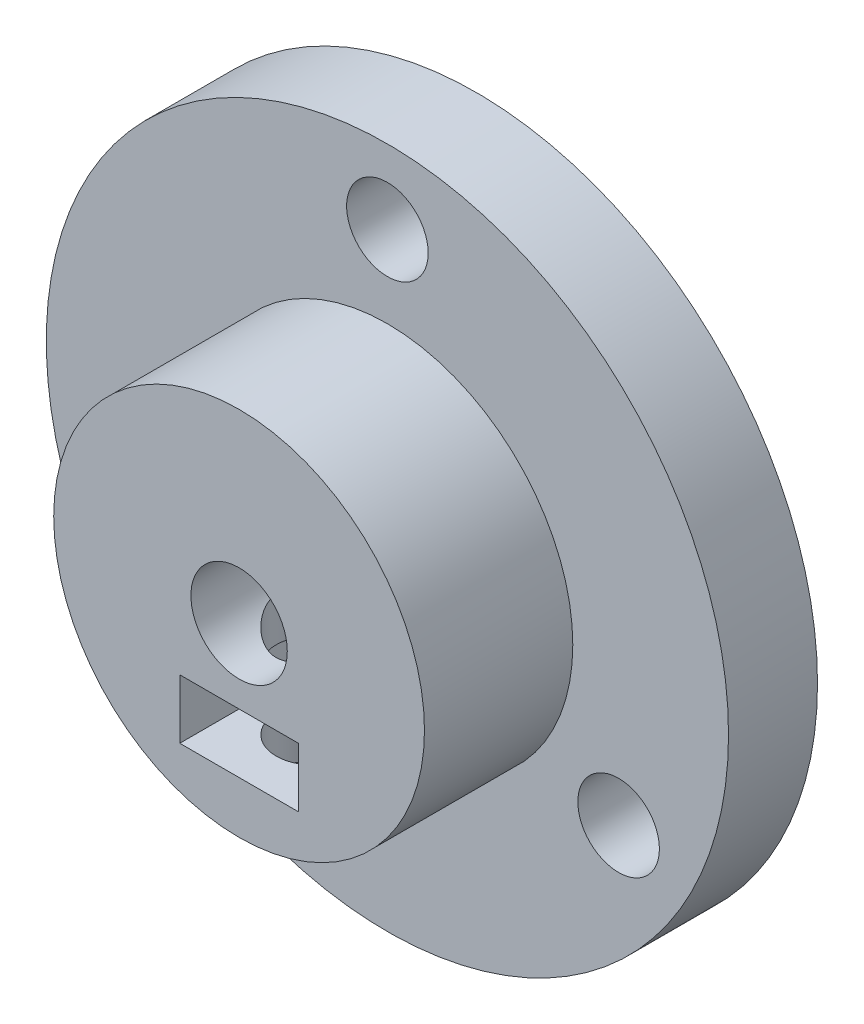
ISO-10303-21;
HEADER;
FILE_DESCRIPTION(('STEP AP214'),'2;1');
FILE_NAME('part.step','',(''),(''),'','','');
FILE_SCHEMA(('AUTOMOTIVE_DESIGN { 1 0 10303 214 1 1 1 1 }'));
ENDSEC;
DATA;
#1=APPLICATION_CONTEXT('core data for automotive mechanical design processes');
#2=APPLICATION_PROTOCOL_DEFINITION('international standard','automotive_design',2000,#1);
#3=PRODUCT_CONTEXT('',#1,'mechanical');
#4=PRODUCT('Part','Part','',(#3));
#5=PRODUCT_RELATED_PRODUCT_CATEGORY('part','',(#4));
#6=PRODUCT_DEFINITION_FORMATION('','',#4);
#7=PRODUCT_DEFINITION_CONTEXT('part definition',#1,'design');
#8=PRODUCT_DEFINITION('design','',#6,#7);
#9=PRODUCT_DEFINITION_SHAPE('','',#8);
#10=(LENGTH_UNIT() NAMED_UNIT(*) SI_UNIT(.MILLI.,.METRE.));
#11=(NAMED_UNIT(*) PLANE_ANGLE_UNIT() SI_UNIT($,.RADIAN.));
#12=(NAMED_UNIT(*) SI_UNIT($,.STERADIAN.) SOLID_ANGLE_UNIT());
#13=UNCERTAINTY_MEASURE_WITH_UNIT(LENGTH_MEASURE(1.E-05),#10,'distance_accuracy_value','');
#14=(GEOMETRIC_REPRESENTATION_CONTEXT(3) GLOBAL_UNCERTAINTY_ASSIGNED_CONTEXT((#13)) GLOBAL_UNIT_ASSIGNED_CONTEXT((#10,
#11,#12)) REPRESENTATION_CONTEXT('',''));
#15=CARTESIAN_POINT('',(0.,0.,0.));
#16=DIRECTION('',(0.,0.,1.));
#17=DIRECTION('',(1.,0.,0.));
#18=AXIS2_PLACEMENT_3D('',#15,#16,#17);
#19=CARTESIAN_POINT('',(0.,-23.001,11.));
#20=DIRECTION('',(0.,1.,0.));
#21=DIRECTION('',(0.,0.,1.));
#22=AXIS2_PLACEMENT_3D('',#19,#20,#21);
#23=CYLINDRICAL_SURFACE('',#22,2.5);
#24=CARTESIAN_POINT('',(0.,-9.,11.));
#25=DIRECTION('',(0.,-1.,0.));
#26=DIRECTION('',(0.,0.,-1.));
#27=AXIS2_PLACEMENT_3D('',#24,#25,#26);
#28=CIRCLE('',#27,2.5);
#29=CARTESIAN_POINT('',(0.,-9.,8.5));
#30=VERTEX_POINT('',#29);
#31=EDGE_CURVE('E40',#30,#30,#28,.F.);
#32=ORIENTED_EDGE('',*,*,#31,.T.);
#33=EDGE_LOOP('',(#32));
#34=FACE_BOUND('',#33,.T.);
#35=CARTESIAN_POINT('',(0.,-12.5,13.5));
#36=CARTESIAN_POINT('',(-0.138942266981583,-12.4999974395218,13.4999948887541));
#37=CARTESIAN_POINT('',(-0.277949150503806,-12.4976596294558,13.4883778925809));
#38=CARTESIAN_POINT('',(-0.552033769222549,-12.4885591405808,13.4422537497119));
#39=CARTESIAN_POINT('',(-0.68710829385339,-12.4817929465047,13.4077284179962));
#40=CARTESIAN_POINT('',(-0.949325763158283,-12.4645912319572,13.316896815948));
#41=CARTESIAN_POINT('',(-1.07647616983284,-12.454159226918,13.2606114078883));
#42=CARTESIAN_POINT('',(-1.31951997216057,-12.4307599508829,13.1279193812218));
#43=CARTESIAN_POINT('',(-1.43541403768953,-12.4177928308927,13.051513960982));
#44=CARTESIAN_POINT('',(-1.65423369328716,-12.3905541332492,12.8796537642714));
#45=CARTESIAN_POINT('',(-1.75698487789631,-12.3762686376087,12.783979111522));
#46=CARTESIAN_POINT('',(-1.94509189152007,-12.3481045113147,12.5767689590207));
#47=CARTESIAN_POINT('',(-2.03044636192606,-12.3342259125106,12.4652322216622));
#48=CARTESIAN_POINT('',(-2.18207938336905,-12.3083110453154,12.2282095174703));
#49=CARTESIAN_POINT('',(-2.24817734716467,-12.2962926841237,12.1026058905091));
#50=CARTESIAN_POINT('',(-2.35826416645077,-12.2756567014604,11.8417954524898));
#51=CARTESIAN_POINT('',(-2.4022552060931,-12.267038744049,11.7065895916341));
#52=CARTESIAN_POINT('',(-2.46631324971207,-12.2543201313051,11.4322890902302));
#53=CARTESIAN_POINT('',(-2.48668624489694,-12.2501617526797,11.2932686396444));
#54=CARTESIAN_POINT('',(-2.5038803193153,-12.2466593765157,11.0137254465891));
#55=CARTESIAN_POINT('',(-2.50070380678375,-12.247314886696,10.8732028591996));
#56=CARTESIAN_POINT('',(-2.47113643275455,-12.2533137787046,10.5968830299475));
#57=CARTESIAN_POINT('',(-2.44509635060976,-12.2585863214691,10.4610464859317));
#58=CARTESIAN_POINT('',(-2.37109471155763,-12.273113654,10.1957098083425));
#59=CARTESIAN_POINT('',(-2.3231321077517,-12.2823686339445,10.0662099777025));
#60=CARTESIAN_POINT('',(-2.2063119591868,-12.3038904625102,9.816211845741));
#61=CARTESIAN_POINT('',(-2.13731537808029,-12.3161772453426,9.69578030107707));
#62=CARTESIAN_POINT('',(-1.9804839364317,-12.3423654693265,9.46807287506796));
#63=CARTESIAN_POINT('',(-1.89264691089207,-12.3562670959591,9.36079850787211));
#64=CARTESIAN_POINT('',(-1.69874983640146,-12.3844255310365,9.16042649385766));
#65=CARTESIAN_POINT('',(-1.59239040303111,-12.3986842302726,9.06761858035217));
#66=CARTESIAN_POINT('',(-1.36546256015502,-12.4257212178602,8.90111538424694));
#67=CARTESIAN_POINT('',(-1.24489396844847,-12.4384994872243,8.82742034676605));
#68=CARTESIAN_POINT('',(-0.992648467197301,-12.4611672540222,8.70118122693506));
#69=CARTESIAN_POINT('',(-0.860954548963249,-12.4710522212068,8.64867026588866));
#70=CARTESIAN_POINT('',(-0.590372441121661,-12.4867852246965,8.56659881490358));
#71=CARTESIAN_POINT('',(-0.451485125181123,-12.4926337500133,8.53703554481593));
#72=CARTESIAN_POINT('',(-0.172948514067876,-12.4995667966717,8.50210886551431));
#73=CARTESIAN_POINT('',(-0.0333508208139401,-12.5007293663117,8.49634895114933));
#74=CARTESIAN_POINT('',(0.244812335481786,-12.4983762982526,8.50812464735545));
#75=CARTESIAN_POINT('',(0.383377856109484,-12.4948609235362,8.52565894838149));
#76=CARTESIAN_POINT('',(0.654264149866353,-12.4835958002004,8.58319593385989));
#77=CARTESIAN_POINT('',(0.786629870849759,-12.4758844101052,8.62299517124476));
#78=CARTESIAN_POINT('',(1.04280906874917,-12.4570888015258,8.72370995663952));
#79=CARTESIAN_POINT('',(1.16662190409385,-12.4460043303557,8.78462708669207));
#80=CARTESIAN_POINT('',(1.40385293421554,-12.4214977883324,8.92670622662828));
#81=CARTESIAN_POINT('',(1.51712531688047,-12.4080487609263,9.00810695259736));
#82=CARTESIAN_POINT('',(1.72854504779802,-12.3803683707471,9.1885229780182));
#83=CARTESIAN_POINT('',(1.82669077232691,-12.3661369242097,9.28754016599967));
#84=CARTESIAN_POINT('',(2.00660147693544,-12.3382325889241,9.50218337972781));
#85=CARTESIAN_POINT('',(2.08809425612164,-12.3245715058326,9.61803936055334));
#86=CARTESIAN_POINT('',(2.23046355012802,-12.2996047949049,9.8620284033917));
#87=CARTESIAN_POINT('',(2.29134088980726,-12.2882990728336,9.99016097393388));
#88=CARTESIAN_POINT('',(2.3903796039549,-12.2694185146096,10.2544206153739));
#89=CARTESIAN_POINT('',(2.42865874947763,-12.2618243718047,10.3905021030258));
#90=CARTESIAN_POINT('',(2.48177162906799,-12.2511859198006,10.6673336337273));
#91=CARTESIAN_POINT('',(2.49660842056278,-12.2481410172778,10.8080830655234));
#92=CARTESIAN_POINT('',(2.50230227716867,-12.2469787407845,11.0875221613608));
#93=CARTESIAN_POINT('',(2.49358947017724,-12.2487729797325,11.2262028723175));
#94=CARTESIAN_POINT('',(2.45338076025015,-12.2568893371153,11.5000791247626));
#95=CARTESIAN_POINT('',(2.42188504032325,-12.2632114191792,11.635274694237));
#96=CARTESIAN_POINT('',(2.33719642124739,-12.279631605479,11.8980692781014));
#97=CARTESIAN_POINT('',(2.28405626679336,-12.2897205254708,12.025685901256));
#98=CARTESIAN_POINT('',(2.15763661150401,-12.3125428743543,12.2702593018361));
#99=CARTESIAN_POINT('',(2.08435542193721,-12.3252765249724,12.3872151843128));
#100=CARTESIAN_POINT('',(1.91826478696603,-12.3522240130806,12.6092889303758));
#101=CARTESIAN_POINT('',(1.82514471808795,-12.3664593227425,12.714171913169));
#102=CARTESIAN_POINT('',(1.62266092253285,-12.3946520467989,12.9069655138229));
#103=CARTESIAN_POINT('',(1.51329346788334,-12.4086093965796,12.9948722257932));
#104=CARTESIAN_POINT('',(1.28004407272062,-12.4348458096993,13.1520866098661));
#105=CARTESIAN_POINT('',(1.15602221107459,-12.4471057804812,13.2211900082001));
#106=CARTESIAN_POINT('',(0.89791590235183,-12.468378127125,13.3374653064915));
#107=CARTESIAN_POINT('',(0.763840652157814,-12.4773934284654,13.3846569738312));
#108=CARTESIAN_POINT('',(0.524553722309448,-12.4894093148843,13.4466298701118));
#109=CARTESIAN_POINT('',(0.420704160034461,-12.4933575789613,13.4666079842694));
#110=CARTESIAN_POINT('',(0.211248813025168,-12.4986538534973,13.4932947808959));
#111=CARTESIAN_POINT('',(0.105643084371548,-12.5000019468289,13.5000038862744));
#112=CARTESIAN_POINT('',(0.,-12.5,13.5));
#113=B_SPLINE_CURVE_WITH_KNOTS('',3,(#35,#36,#37,#38,#39,#40,#41,#42,#43,#44,#45,#46,#47,#48,
#49,#50,#51,#52,#53,#54,#55,#56,#57,#58,#59,#60,#61,#62,#63,#64,#65,#66,#67,#68,#69,#70,#71,#72,
#73,#74,#75,#76,#77,#78,#79,#80,#81,#82,#83,#84,#85,#86,#87,#88,#89,#90,#91,#92,#93,#94,#95,#96,
#97,#98,#99,#100,#101,#102,#103,#104,#105,#106,#107,#108,#109,#110,#111,#112),.UNSPECIFIED.,.T.,
.F.,(4,2,2,2,2,2,2,2,2,2,2,2,2,2,2,2,2,2,2,2,2,2,2,2,2,2,2,2,2,2,2,2,2,2,2,2,2,2,4),(0.,
0.416440326653146,0.833211626728308,1.24958433812585,1.66593225557716,2.08733167528047,
2.50876399186842,2.93402987514807,3.35925373412994,3.77890462758969,4.19851260703063,
4.61179317515696,5.02509348134324,5.44118725508982,5.85732886874176,6.28095631228377,
6.70458918849551,7.1288818713506,7.5531231424509,7.97026839190663,8.38739019144669,
8.80076134876809,9.21416348040056,9.63262665083397,10.0511347086483,10.4760157144806,
10.9008797180867,11.3235095258181,11.7460842082604,12.1609930641925,12.5758985873152,
12.9897990313278,13.4037341895467,13.8247019059786,14.2457663633233,14.6712374168909,
15.096323887938,15.4129693822474,15.7296047842749),.UNSPECIFIED.);
#114=CARTESIAN_POINT('',(0.,-12.5,13.5));
#115=VERTEX_POINT('',#114);
#116=EDGE_CURVE('E134',#115,#115,#113,.T.);
#117=ORIENTED_EDGE('',*,*,#116,.T.);
#118=EDGE_LOOP('',(#117));
#119=FACE_BOUND('',#118,.T.);
#120=ADVANCED_FACE('F36',(#34,#119),#23,.F.);
#121=CARTESIAN_POINT('',(0.,0.,6.));
#122=DIRECTION('',(0.,0.,-1.));
#123=DIRECTION('',(-1.,0.,0.));
#124=AXIS2_PLACEMENT_3D('',#121,#122,#123);
#125=CYLINDRICAL_SURFACE('',#124,23.);
#126=CARTESIAN_POINT('',(0.,0.,6.));
#127=DIRECTION('',(0.,0.,1.));
#128=DIRECTION('',(1.,0.,0.));
#129=AXIS2_PLACEMENT_3D('',#126,#127,#128);
#130=CIRCLE('',#129,23.);
#131=CARTESIAN_POINT('',(23.,0.,6.));
#132=VERTEX_POINT('',#131);
#133=EDGE_CURVE('E12',#132,#132,#130,.T.);
#134=ORIENTED_EDGE('',*,*,#133,.F.);
#135=EDGE_LOOP('',(#134));
#136=FACE_BOUND('',#135,.T.);
#137=CARTESIAN_POINT('',(0.,0.,0.));
#138=DIRECTION('',(0.,0.,1.));
#139=DIRECTION('',(1.,0.,0.));
#140=AXIS2_PLACEMENT_3D('',#137,#138,#139);
#141=CIRCLE('',#140,23.);
#142=CARTESIAN_POINT('',(23.,0.,0.));
#143=VERTEX_POINT('',#142);
#144=EDGE_CURVE('E45',#143,#143,#141,.T.);
#145=ORIENTED_EDGE('',*,*,#144,.T.);
#146=EDGE_LOOP('',(#145));
#147=FACE_BOUND('',#146,.T.);
#148=ADVANCED_FACE('F38',(#136,#147),#125,.T.);
#149=CARTESIAN_POINT('',(0.,0.,6.));
#150=DIRECTION('',(0.,0.,1.));
#151=DIRECTION('',(1.,0.,0.));
#152=AXIS2_PLACEMENT_3D('',#149,#150,#151);
#153=PLANE('',#152);
#154=CARTESIAN_POINT('',(15.58845726812,-8.9999999999998,6.));
#155=DIRECTION('',(0.,0.,1.));
#156=DIRECTION('',(-0.499999999999989,-0.866025403784445,0.));
#157=AXIS2_PLACEMENT_3D('',#154,#155,#156);
#158=CIRCLE('',#157,2.75);
#159=CARTESIAN_POINT('',(14.21345726812,-11.381569860407,6.));
#160=VERTEX_POINT('',#159);
#161=EDGE_CURVE('E116',#160,#160,#158,.T.);
#162=ORIENTED_EDGE('',*,*,#161,.F.);
#163=EDGE_LOOP('',(#162));
#164=FACE_BOUND('',#163,.T.);
#165=CARTESIAN_POINT('',(-15.5884572681199,-8.99999999999998,6.));
#166=DIRECTION('',(0.,0.,1.));
#167=DIRECTION('',(-0.499999999999999,0.866025403784439,0.));
#168=AXIS2_PLACEMENT_3D('',#165,#166,#167);
#169=CIRCLE('',#168,2.75);
#170=CARTESIAN_POINT('',(-16.9634572681199,-6.61843013959278,6.));
#171=VERTEX_POINT('',#170);
#172=EDGE_CURVE('E122',#171,#171,#169,.T.);
#173=ORIENTED_EDGE('',*,*,#172,.F.);
#174=EDGE_LOOP('',(#173));
#175=FACE_BOUND('',#174,.T.);
#176=CARTESIAN_POINT('',(0.,18.,6.));
#177=DIRECTION('',(0.,0.,1.));
#178=DIRECTION('',(1.,0.,0.));
#179=AXIS2_PLACEMENT_3D('',#176,#177,#178);
#180=CIRCLE('',#179,2.75);
#181=CARTESIAN_POINT('',(2.75,18.,6.));
#182=VERTEX_POINT('',#181);
#183=EDGE_CURVE('E128',#182,#182,#180,.T.);
#184=ORIENTED_EDGE('',*,*,#183,.F.);
#185=EDGE_LOOP('',(#184));
#186=FACE_BOUND('',#185,.T.);
#187=CARTESIAN_POINT('',(0.,0.,6.));
#188=DIRECTION('',(0.,0.,1.));
#189=DIRECTION('',(1.,0.,0.));
#190=AXIS2_PLACEMENT_3D('',#187,#188,#189);
#191=CIRCLE('',#190,12.5);
#192=CARTESIAN_POINT('',(12.5,0.,6.));
#193=VERTEX_POINT('',#192);
#194=EDGE_CURVE('E204',#193,#193,#191,.T.);
#195=ORIENTED_EDGE('',*,*,#194,.F.);
#196=EDGE_LOOP('',(#195));
#197=FACE_BOUND('',#196,.T.);
#198=ORIENTED_EDGE('',*,*,#133,.T.);
#199=EDGE_LOOP('',(#198));
#200=FACE_BOUND('',#199,.T.);
#201=ADVANCED_FACE('F187',(#164,#175,#186,#197,#200),#153,.T.);
#202=CARTESIAN_POINT('',(0.,0.,0.));
#203=DIRECTION('',(0.,0.,1.));
#204=DIRECTION('',(1.,0.,0.));
#205=AXIS2_PLACEMENT_3D('',#202,#203,#204);
#206=PLANE('',#205);
#207=CARTESIAN_POINT('',(15.58845726812,-8.9999999999998,0.));
#208=DIRECTION('',(0.,0.,1.));
#209=DIRECTION('',(1.,0.,0.));
#210=AXIS2_PLACEMENT_3D('',#207,#208,#209);
#211=CIRCLE('',#210,2.75);
#212=CARTESIAN_POINT('',(18.33845726812,-8.9999999999998,0.));
#213=VERTEX_POINT('',#212);
#214=EDGE_CURVE('E119',#213,#213,#211,.F.);
#215=ORIENTED_EDGE('',*,*,#214,.F.);
#216=EDGE_LOOP('',(#215));
#217=FACE_BOUND('',#216,.T.);
#218=CARTESIAN_POINT('',(-15.5884572681199,-8.99999999999998,0.));
#219=DIRECTION('',(0.,0.,1.));
#220=DIRECTION('',(1.,0.,0.));
#221=AXIS2_PLACEMENT_3D('',#218,#219,#220);
#222=CIRCLE('',#221,2.75);
#223=CARTESIAN_POINT('',(-12.8384572681199,-8.99999999999998,0.));
#224=VERTEX_POINT('',#223);
#225=EDGE_CURVE('E125',#224,#224,#222,.F.);
#226=ORIENTED_EDGE('',*,*,#225,.F.);
#227=EDGE_LOOP('',(#226));
#228=FACE_BOUND('',#227,.T.);
#229=CARTESIAN_POINT('',(0.,18.,0.));
#230=DIRECTION('',(0.,0.,1.));
#231=DIRECTION('',(1.,0.,0.));
#232=AXIS2_PLACEMENT_3D('',#229,#230,#231);
#233=CIRCLE('',#232,2.75);
#234=CARTESIAN_POINT('',(2.75,18.,0.));
#235=VERTEX_POINT('',#234);
#236=EDGE_CURVE('E131',#235,#235,#233,.F.);
#237=ORIENTED_EDGE('',*,*,#236,.F.);
#238=EDGE_LOOP('',(#237));
#239=FACE_BOUND('',#238,.T.);
#240=CARTESIAN_POINT('',(0.,0.,0.));
#241=DIRECTION('',(0.,0.,1.));
#242=DIRECTION('',(1.,0.,0.));
#243=AXIS2_PLACEMENT_3D('',#240,#241,#242);
#244=CIRCLE('',#243,3.25);
#245=CARTESIAN_POINT('',(3.25,0.,0.));
#246=VERTEX_POINT('',#245);
#247=EDGE_CURVE('E201',#246,#246,#244,.F.);
#248=ORIENTED_EDGE('',*,*,#247,.F.);
#249=EDGE_LOOP('',(#248));
#250=FACE_BOUND('',#249,.T.);
#251=ORIENTED_EDGE('',*,*,#144,.F.);
#252=EDGE_LOOP('',(#251));
#253=FACE_BOUND('',#252,.T.);
#254=ADVANCED_FACE('F216',(#217,#228,#239,#250,#253),#206,.F.);
#255=CARTESIAN_POINT('',(0.,0.,16.));
#256=DIRECTION('',(0.,0.,-1.));
#257=DIRECTION('',(-1.,0.,0.));
#258=AXIS2_PLACEMENT_3D('',#255,#256,#257);
#259=CYLINDRICAL_SURFACE('',#258,12.5);
#260=ORIENTED_EDGE('',*,*,#116,.F.);
#261=EDGE_LOOP('',(#260));
#262=FACE_BOUND('',#261,.T.);
#263=CARTESIAN_POINT('',(0.,0.,16.));
#264=DIRECTION('',(0.,0.,1.));
#265=DIRECTION('',(1.,0.,0.));
#266=AXIS2_PLACEMENT_3D('',#263,#264,#265);
#267=CIRCLE('',#266,12.5);
#268=CARTESIAN_POINT('',(12.5,0.,16.));
#269=VERTEX_POINT('',#268);
#270=EDGE_CURVE('E206',#269,#269,#267,.T.);
#271=ORIENTED_EDGE('',*,*,#270,.F.);
#272=EDGE_LOOP('',(#271));
#273=FACE_BOUND('',#272,.T.);
#274=ORIENTED_EDGE('',*,*,#194,.T.);
#275=EDGE_LOOP('',(#274));
#276=FACE_BOUND('',#275,.T.);
#277=ADVANCED_FACE('F218',(#262,#273,#276),#259,.T.);
#278=CARTESIAN_POINT('',(0.,0.,16.));
#279=DIRECTION('',(0.,0.,1.));
#280=DIRECTION('',(1.,0.,0.));
#281=AXIS2_PLACEMENT_3D('',#278,#279,#280);
#282=PLANE('',#281);
#283=DIRECTION('',(0.,1.,0.));
#284=VECTOR('',#283,1.);
#285=CARTESIAN_POINT('',(4.,-5.,16.));
#286=LINE('',#285,#284);
#287=CARTESIAN_POINT('',(4.,-9.,16.));
#288=VERTEX_POINT('',#287);
#289=CARTESIAN_POINT('',(4.,-5.,16.));
#290=VERTEX_POINT('',#289);
#291=EDGE_CURVE('E53',#288,#290,#286,.T.);
#292=ORIENTED_EDGE('',*,*,#291,.F.);
#293=DIRECTION('',(1.,0.,0.));
#294=VECTOR('',#293,1.);
#295=CARTESIAN_POINT('',(-4.,-9.,16.));
#296=LINE('',#295,#294);
#297=CARTESIAN_POINT('',(-4.,-9.,16.));
#298=VERTEX_POINT('',#297);
#299=EDGE_CURVE('E103',#298,#288,#296,.T.);
#300=ORIENTED_EDGE('',*,*,#299,.F.);
#301=DIRECTION('',(0.,-1.,0.));
#302=VECTOR('',#301,1.);
#303=CARTESIAN_POINT('',(-4.,-5.,16.));
#304=LINE('',#303,#302);
#305=CARTESIAN_POINT('',(-4.,-5.,16.));
#306=VERTEX_POINT('',#305);
#307=EDGE_CURVE('E86',#306,#298,#304,.T.);
#308=ORIENTED_EDGE('',*,*,#307,.F.);
#309=DIRECTION('',(-1.,0.,0.));
#310=VECTOR('',#309,1.);
#311=CARTESIAN_POINT('',(-4.,-5.,16.));
#312=LINE('',#311,#310);
#313=EDGE_CURVE('E95',#290,#306,#312,.T.);
#314=ORIENTED_EDGE('',*,*,#313,.F.);
#315=EDGE_LOOP('',(#292,#300,#308,#314));
#316=FACE_BOUND('',#315,.T.);
#317=CARTESIAN_POINT('',(0.,0.,16.));
#318=DIRECTION('',(0.,0.,1.));
#319=DIRECTION('',(1.,0.,0.));
#320=AXIS2_PLACEMENT_3D('',#317,#318,#319);
#321=CIRCLE('',#320,3.25);
#322=CARTESIAN_POINT('',(3.25,0.,16.));
#323=VERTEX_POINT('',#322);
#324=EDGE_CURVE('E142',#323,#323,#321,.T.);
#325=ORIENTED_EDGE('',*,*,#324,.F.);
#326=EDGE_LOOP('',(#325));
#327=FACE_BOUND('',#326,.T.);
#328=ORIENTED_EDGE('',*,*,#270,.T.);
#329=EDGE_LOOP('',(#328));
#330=FACE_BOUND('',#329,.T.);
#331=ADVANCED_FACE('F100',(#316,#327,#330),#282,.T.);
#332=CARTESIAN_POINT('',(0.,0.,-9.19238815542512));
#333=DIRECTION('',(0.,0.,1.));
#334=DIRECTION('',(1.,0.,0.));
#335=AXIS2_PLACEMENT_3D('',#332,#333,#334);
#336=CYLINDRICAL_SURFACE('',#335,3.25);
#337=CARTESIAN_POINT('',(0.,-3.25,13.5));
#338=CARTESIAN_POINT('',(-0.121348553572939,-3.24999045350386,13.4999901110935));
#339=CARTESIAN_POINT('',(-0.242813691183046,-3.24313674214412,13.4910976976686));
#340=CARTESIAN_POINT('',(-0.481831137273764,-3.21634389171274,13.4561126311426));
#341=CARTESIAN_POINT('',(-0.599376959734738,-3.19638409318161,13.4299928217676));
#342=CARTESIAN_POINT('',(-0.826536911092769,-3.14528524520748,13.3623729845508));
#343=CARTESIAN_POINT('',(-0.936193030962689,-3.11421160506572,13.3209629007282));
#344=CARTESIAN_POINT('',(-1.14623785494923,-3.04318083044143,13.2247473412022));
#345=CARTESIAN_POINT('',(-1.24662701927908,-3.00322413744313,13.1699425311979));
#346=CARTESIAN_POINT('',(-1.44600844121602,-2.91283957929087,13.0431119123073));
#347=CARTESIAN_POINT('',(-1.54398850368458,-2.86178138460674,12.9699536928457));
#348=CARTESIAN_POINT('',(-1.72706898598944,-2.75517356947267,12.8116045783565));
#349=CARTESIAN_POINT('',(-1.81215048569007,-2.69961753105323,12.7263963550591));
#350=CARTESIAN_POINT('',(-1.98575292216533,-2.57545045421695,12.5257718989664));
#351=CARTESIAN_POINT('',(-2.07113497880181,-2.50658291949386,12.4077893002521));
#352=CARTESIAN_POINT('',(-2.2212796027211,-2.37452117616202,12.1564215181657));
#353=CARTESIAN_POINT('',(-2.2860663128604,-2.31132038761201,12.0230546209368));
#354=CARTESIAN_POINT('',(-2.37350245752466,-2.22068967712353,11.7911414976279));
#355=CARTESIAN_POINT('',(-2.40294643390421,-2.18852466882349,11.6970328862035));
#356=CARTESIAN_POINT('',(-2.45084990332516,-2.13474505533935,11.5032426116097));
#357=CARTESIAN_POINT('',(-2.46933518656955,-2.11310570080643,11.4035746420864));
#358=CARTESIAN_POINT('',(-2.49416209263567,-2.08376164397217,11.1994968443807));
#359=CARTESIAN_POINT('',(-2.50037313299083,-2.07620683083073,11.0950479968003));
#360=CARTESIAN_POINT('',(-2.49959192937503,-2.07714716023308,10.8862604328367));
#361=CARTESIAN_POINT('',(-2.4925986946756,-2.08564350710965,10.7819217253051));
#362=CARTESIAN_POINT('',(-2.46781267537085,-2.114872580323,10.5900064256641));
#363=CARTESIAN_POINT('',(-2.45147916218909,-2.13394293697894,10.5019649048181));
#364=CARTESIAN_POINT('',(-2.41022538545488,-2.1804317450951,10.3302042392671));
#365=CARTESIAN_POINT('',(-2.38529576383677,-2.20785929072228,10.2464899200116));
#366=CARTESIAN_POINT('',(-2.30888444465928,-2.2882922644855,10.0307555792468));
#367=CARTESIAN_POINT('',(-2.25070324048774,-2.34628974955749,9.90297736593192));
#368=CARTESIAN_POINT('',(-2.11571576357108,-2.46872690116902,9.66096324719528));
#369=CARTESIAN_POINT('',(-2.03886211073163,-2.53318270683204,9.54676291040301));
#370=CARTESIAN_POINT('',(-1.86473551868168,-2.66411839535363,9.32882608099276));
#371=CARTESIAN_POINT('',(-1.76687749698615,-2.73059560749075,9.22555334606421));
#372=CARTESIAN_POINT('',(-1.55301590868676,-2.85763379610431,9.03568911126613));
#373=CARTESIAN_POINT('',(-1.43704522023972,-2.91820517545496,8.94906800873174));
#374=CARTESIAN_POINT('',(-1.2106339979163,-3.01815770073048,8.8094101446316));
#375=CARTESIAN_POINT('',(-1.10302179821517,-3.05938925500898,8.75313064250296));
#376=CARTESIAN_POINT('',(-0.877760004905152,-3.13145103401655,8.65595403698233));
#377=CARTESIAN_POINT('',(-0.760116078876753,-3.16228708370275,8.61504831765287));
#378=CARTESIAN_POINT('',(-0.516571200110349,-3.21110056102949,8.55069164420213));
#379=CARTESIAN_POINT('',(-0.390617749579285,-3.22898553479023,8.52736614276741));
#380=CARTESIAN_POINT('',(-0.135412984561603,-3.2496942471058,8.5003816805261));
#381=CARTESIAN_POINT('',(-0.0061638057050163,-3.2525275018773,8.49671029369807));
#382=CARTESIAN_POINT('',(0.235764655836953,-3.24343250361131,8.50854261726005));
#383=CARTESIAN_POINT('',(0.348624757135461,-3.23318067853943,8.52186853792155));
#384=CARTESIAN_POINT('',(0.5699851544815,-3.20158084242707,8.56324022915985));
#385=CARTESIAN_POINT('',(0.678484715761967,-3.18023096970003,8.59128846939896));
#386=CARTESIAN_POINT('',(0.890464533830693,-3.12757389412467,8.66124880543788));
#387=CARTESIAN_POINT('',(0.993826989564815,-3.09610240543415,8.70339013298607));
#388=CARTESIAN_POINT('',(1.19188084801526,-3.02539097882099,8.79964630766413));
#389=CARTESIAN_POINT('',(1.28657080493337,-2.98614974903475,8.85376314612108));
#390=CARTESIAN_POINT('',(1.48090741528084,-2.89528883822034,8.9819400600439));
#391=CARTESIAN_POINT('',(1.57889783677964,-2.84269339646409,9.05780821454179));
#392=CARTESIAN_POINT('',(1.76159121809807,-2.73324893561082,9.22182446721173));
#393=CARTESIAN_POINT('',(1.84626965492683,-2.67639234468686,9.30999467697185));
#394=CARTESIAN_POINT('',(1.97091677455521,-2.58483738864233,9.46023374232235));
#395=CARTESIAN_POINT('',(2.0153025314138,-2.55028964843412,9.51879453526294));
#396=CARTESIAN_POINT('',(2.09894926990365,-2.48189994603675,9.63991489230918));
#397=CARTESIAN_POINT('',(2.13820849793904,-2.44805822866054,9.70247581386691));
#398=CARTESIAN_POINT('',(2.21133153078824,-2.38221107490474,9.83145412363114));
#399=CARTESIAN_POINT('',(2.24520353483068,-2.350202896368,9.89786543726439));
#400=CARTESIAN_POINT('',(2.30730742148475,-2.28926302069561,10.0346133432003));
#401=CARTESIAN_POINT('',(2.33554072339724,-2.26033055024242,10.1049489420159));
#402=CARTESIAN_POINT('',(2.39217341004581,-2.20047668217637,10.2674527608577));
#403=CARTESIAN_POINT('',(2.4188803755898,-2.17083894453747,10.3607122400671));
#404=CARTESIAN_POINT('',(2.46152423537021,-2.12237089694493,10.5522500442763));
#405=CARTESIAN_POINT('',(2.47748736401259,-2.10351427863679,10.650515509176));
#406=CARTESIAN_POINT('',(2.49759550494928,-2.07961265393486,10.8509358906066));
#407=CARTESIAN_POINT('',(2.50163199954093,-2.0746944866777,10.9531180031329));
#408=CARTESIAN_POINT('',(2.49715911512228,-2.08007233986507,11.156824755699));
#409=CARTESIAN_POINT('',(2.48864233114791,-2.09037734020356,11.2583489721678));
#410=CARTESIAN_POINT('',(2.45833090529554,-2.12595469901967,11.4679955078786));
#411=CARTESIAN_POINT('',(2.43521265354506,-2.15271101483804,11.5756609611802));
#412=CARTESIAN_POINT('',(2.37637318485219,-2.21748825385186,11.7839867896695));
#413=CARTESIAN_POINT('',(2.34061841539303,-2.25553912287913,11.8846276528158));
#414=CARTESIAN_POINT('',(2.24047066907344,-2.35577390982544,12.1192756868882));
#415=CARTESIAN_POINT('',(2.17036187195915,-2.42135483730996,12.249370838816));
#416=CARTESIAN_POINT('',(2.00974237178779,-2.5562679567725,12.4941175509216));
#417=CARTESIAN_POINT('',(1.91920436050694,-2.62560507458904,12.6087481084293));
#418=CARTESIAN_POINT('',(1.71626272941882,-2.76265874918916,12.82394598204));
#419=CARTESIAN_POINT('',(1.60342204139121,-2.83030613488936,12.924148590999));
#420=CARTESIAN_POINT('',(1.35805430643705,-2.95585478606715,13.1044564157106));
#421=CARTESIAN_POINT('',(1.22557030720501,-3.01377678693476,13.18460457305));
#422=CARTESIAN_POINT('',(0.980423317008698,-3.10056051993675,13.3026307667997));
#423=CARTESIAN_POINT('',(0.871722478701705,-3.13305837454582,13.3460820984045));
#424=CARTESIAN_POINT('',(0.646901307498261,-3.18705097130749,13.4177170259811));
#425=CARTESIAN_POINT('',(0.53079756358862,-3.20856940527983,13.4459335040393));
#426=CARTESIAN_POINT('',(0.344772963461902,-3.23238737897786,13.4770699415088));
#427=CARTESIAN_POINT('',(0.276287230790281,-3.23896972999378,13.4856465160746));
#428=CARTESIAN_POINT('',(0.138547117331003,-3.24777926043796,13.4971150139095));
#429=CARTESIAN_POINT('',(0.0692925656478077,-3.25000545124924,13.5000056467727));
#430=CARTESIAN_POINT('',(0.,-3.25,13.5));
#431=B_SPLINE_CURVE_WITH_KNOTS('',3,(#337,#338,#339,#340,#341,#342,#343,#344,#345,#346,#347,
#348,#349,#350,#351,#352,#353,#354,#355,#356,#357,#358,#359,#360,#361,#362,#363,#364,#365,#366,
#367,#368,#369,#370,#371,#372,#373,#374,#375,#376,#377,#378,#379,#380,#381,#382,#383,#384,#385,
#386,#387,#388,#389,#390,#391,#392,#393,#394,#395,#396,#397,#398,#399,#400,#401,#402,#403,#404,
#405,#406,#407,#408,#409,#410,#411,#412,#413,#414,#415,#416,#417,#418,#419,#420,#421,#422,#423,
#424,#425,#426,#427,#428,#429,#430),.UNSPECIFIED.,.T.,.F.,(4,2,2,2,2,2,2,2,2,2,2,2,2,2,2,2,2,2,
2,2,2,2,2,2,2,2,2,2,2,2,2,2,2,2,2,2,2,2,2,2,2,2,2,2,2,2,4),(0.,0.363751507624913,
0.728077786996625,1.09029422434735,1.45249266370743,1.84862764937112,2.24533819384756,
2.72668603253498,3.20746751341441,3.51764073538693,3.82708106730641,4.1397961015551,
4.45253460002256,4.72617933081476,5.00012290761785,5.45334988690256,5.90773913571353,
6.37697365087223,6.84536610310162,7.22859533181235,7.61160946575625,7.9973315696974,
8.38280977775316,8.72351191029883,9.06427121374374,9.41086704510604,9.7575205529209,
10.1599825831496,10.5631775434252,10.8065442411525,11.0499939687653,11.2930695507043,
11.5360838714895,11.839315614088,12.1418042097708,12.4470367313326,12.7524493764053,
13.0905515123328,13.4295582072215,13.9120851145945,14.3952608890974,14.8890623488925,
15.3817972296054,15.744831323638,16.1070787000162,16.314741306465,16.522451035831),.UNSPECIFIED.);
#432=CARTESIAN_POINT('',(0.,-3.25,13.5));
#433=VERTEX_POINT('',#432);
#434=EDGE_CURVE('E141',#433,#433,#431,.T.);
#435=ORIENTED_EDGE('',*,*,#434,.T.);
#436=EDGE_LOOP('',(#435));
#437=FACE_BOUND('',#436,.T.);
#438=ORIENTED_EDGE('',*,*,#247,.T.);
#439=EDGE_LOOP('',(#438));
#440=FACE_BOUND('',#439,.T.);
#441=ORIENTED_EDGE('',*,*,#324,.T.);
#442=EDGE_LOOP('',(#441));
#443=FACE_BOUND('',#442,.T.);
#444=ADVANCED_FACE('F149',(#437,#440,#443),#336,.F.);
#445=CARTESIAN_POINT('',(0.,-5.,11.));
#446=DIRECTION('',(0.,1.,0.));
#447=DIRECTION('',(-1.,0.,0.));
#448=AXIS2_PLACEMENT_3D('',#445,#446,#447);
#449=CIRCLE('',#448,2.5);
#450=CARTESIAN_POINT('',(-2.5,-5.,11.));
#451=VERTEX_POINT('',#450);
#452=EDGE_CURVE('E114',#451,#451,#449,.F.);
#453=ORIENTED_EDGE('',*,*,#452,.T.);
#454=EDGE_LOOP('',(#453));
#455=FACE_BOUND('',#454,.T.);
#456=ORIENTED_EDGE('',*,*,#434,.F.);
#457=EDGE_LOOP('',(#456));
#458=FACE_BOUND('',#457,.T.);
#459=ADVANCED_FACE('F144',(#455,#458),#23,.F.);
#460=CARTESIAN_POINT('',(0.,18.,-7.77817459305202));
#461=DIRECTION('',(0.,0.,1.));
#462=DIRECTION('',(1.,0.,0.));
#463=AXIS2_PLACEMENT_3D('',#460,#461,#462);
#464=CYLINDRICAL_SURFACE('',#463,2.75);
#465=ORIENTED_EDGE('',*,*,#236,.T.);
#466=EDGE_LOOP('',(#465));
#467=FACE_BOUND('',#466,.T.);
#468=ORIENTED_EDGE('',*,*,#183,.T.);
#469=EDGE_LOOP('',(#468));
#470=FACE_BOUND('',#469,.T.);
#471=ADVANCED_FACE('F190',(#467,#470),#464,.F.);
#472=CARTESIAN_POINT('',(-15.5884572681199,-8.99999999999998,-7.77817459305202));
#473=DIRECTION('',(0.,0.,1.));
#474=DIRECTION('',(1.,0.,0.));
#475=AXIS2_PLACEMENT_3D('',#472,#473,#474);
#476=CYLINDRICAL_SURFACE('',#475,2.75);
#477=ORIENTED_EDGE('',*,*,#225,.T.);
#478=EDGE_LOOP('',(#477));
#479=FACE_BOUND('',#478,.T.);
#480=ORIENTED_EDGE('',*,*,#172,.T.);
#481=EDGE_LOOP('',(#480));
#482=FACE_BOUND('',#481,.T.);
#483=ADVANCED_FACE('F178',(#479,#482),#476,.F.);
#484=CARTESIAN_POINT('',(15.58845726812,-8.9999999999998,-7.77817459305202));
#485=DIRECTION('',(0.,0.,1.));
#486=DIRECTION('',(1.,0.,0.));
#487=AXIS2_PLACEMENT_3D('',#484,#485,#486);
#488=CYLINDRICAL_SURFACE('',#487,2.75);
#489=ORIENTED_EDGE('',*,*,#214,.T.);
#490=EDGE_LOOP('',(#489));
#491=FACE_BOUND('',#490,.T.);
#492=ORIENTED_EDGE('',*,*,#161,.T.);
#493=EDGE_LOOP('',(#492));
#494=FACE_BOUND('',#493,.T.);
#495=ADVANCED_FACE('F170',(#491,#494),#488,.F.);
#496=CARTESIAN_POINT('',(-4.,-9.,-2.94427190999916));
#497=DIRECTION('',(0.,-1.,0.));
#498=DIRECTION('',(0.,0.,-1.));
#499=AXIS2_PLACEMENT_3D('',#496,#497,#498);
#500=PLANE('',#499);
#501=DIRECTION('',(-1.,0.,0.));
#502=VECTOR('',#501,1.);
#503=CARTESIAN_POINT('',(-4.,-9.,6.));
#504=LINE('',#503,#502);
#505=CARTESIAN_POINT('',(4.,-9.,6.));
#506=VERTEX_POINT('',#505);
#507=CARTESIAN_POINT('',(-4.,-9.,6.));
#508=VERTEX_POINT('',#507);
#509=EDGE_CURVE('E62',#506,#508,#504,.T.);
#510=ORIENTED_EDGE('',*,*,#509,.T.);
#511=DIRECTION('',(0.,0.,1.));
#512=VECTOR('',#511,1.);
#513=CARTESIAN_POINT('',(-4.,-9.,-2.94427190999916));
#514=LINE('',#513,#512);
#515=EDGE_CURVE('E91',#508,#298,#514,.T.);
#516=ORIENTED_EDGE('',*,*,#515,.T.);
#517=ORIENTED_EDGE('',*,*,#299,.T.);
#518=DIRECTION('',(0.,0.,1.));
#519=VECTOR('',#518,1.);
#520=CARTESIAN_POINT('',(4.,-9.,-2.94427190999916));
#521=LINE('',#520,#519);
#522=EDGE_CURVE('E108',#506,#288,#521,.T.);
#523=ORIENTED_EDGE('',*,*,#522,.F.);
#524=EDGE_LOOP('',(#510,#516,#517,#523));
#525=FACE_BOUND('',#524,.T.);
#526=ORIENTED_EDGE('',*,*,#31,.F.);
#527=EDGE_LOOP('',(#526));
#528=FACE_BOUND('',#527,.T.);
#529=ADVANCED_FACE('F168',(#525,#528),#500,.F.);
#530=CARTESIAN_POINT('',(-4.,-5.,-2.94427190999916));
#531=DIRECTION('',(0.,1.,0.));
#532=DIRECTION('',(-1.,0.,0.));
#533=AXIS2_PLACEMENT_3D('',#530,#531,#532);
#534=PLANE('',#533);
#535=DIRECTION('',(1.,0.,0.));
#536=VECTOR('',#535,1.);
#537=CARTESIAN_POINT('',(-4.,-5.,6.));
#538=LINE('',#537,#536);
#539=CARTESIAN_POINT('',(-4.,-5.,6.));
#540=VERTEX_POINT('',#539);
#541=CARTESIAN_POINT('',(4.,-5.,6.));
#542=VERTEX_POINT('',#541);
#543=EDGE_CURVE('E112',#540,#542,#538,.T.);
#544=ORIENTED_EDGE('',*,*,#543,.T.);
#545=DIRECTION('',(0.,0.,1.));
#546=VECTOR('',#545,1.);
#547=CARTESIAN_POINT('',(4.,-5.,-2.94427190999916));
#548=LINE('',#547,#546);
#549=EDGE_CURVE('E92',#542,#290,#548,.T.);
#550=ORIENTED_EDGE('',*,*,#549,.T.);
#551=ORIENTED_EDGE('',*,*,#313,.T.);
#552=DIRECTION('',(0.,0.,1.));
#553=VECTOR('',#552,1.);
#554=CARTESIAN_POINT('',(-4.,-5.,-2.94427190999916));
#555=LINE('',#554,#553);
#556=EDGE_CURVE('E81',#540,#306,#555,.T.);
#557=ORIENTED_EDGE('',*,*,#556,.F.);
#558=EDGE_LOOP('',(#544,#550,#551,#557));
#559=FACE_BOUND('',#558,.T.);
#560=ORIENTED_EDGE('',*,*,#452,.F.);
#561=EDGE_LOOP('',(#560));
#562=FACE_BOUND('',#561,.T.);
#563=ADVANCED_FACE('F96',(#559,#562),#534,.F.);
#564=CARTESIAN_POINT('',(4.,-5.,-2.94427190999916));
#565=DIRECTION('',(1.,0.,0.));
#566=DIRECTION('',(0.,0.,-1.));
#567=AXIS2_PLACEMENT_3D('',#564,#565,#566);
#568=PLANE('',#567);
#569=DIRECTION('',(0.,-1.,0.));
#570=VECTOR('',#569,1.);
#571=CARTESIAN_POINT('',(4.,-5.,6.));
#572=LINE('',#571,#570);
#573=EDGE_CURVE('E115',#542,#506,#572,.T.);
#574=ORIENTED_EDGE('',*,*,#573,.T.);
#575=ORIENTED_EDGE('',*,*,#522,.T.);
#576=ORIENTED_EDGE('',*,*,#291,.T.);
#577=ORIENTED_EDGE('',*,*,#549,.F.);
#578=EDGE_LOOP('',(#574,#575,#576,#577));
#579=FACE_BOUND('',#578,.T.);
#580=ADVANCED_FACE('F176',(#579),#568,.F.);
#581=CARTESIAN_POINT('',(-4.,-5.,-2.94427190999916));
#582=DIRECTION('',(-1.,0.,0.));
#583=DIRECTION('',(0.,0.,1.));
#584=AXIS2_PLACEMENT_3D('',#581,#582,#583);
#585=PLANE('',#584);
#586=DIRECTION('',(0.,1.,0.));
#587=VECTOR('',#586,1.);
#588=CARTESIAN_POINT('',(-4.,-5.,6.));
#589=LINE('',#588,#587);
#590=EDGE_CURVE('E88',#508,#540,#589,.T.);
#591=ORIENTED_EDGE('',*,*,#590,.T.);
#592=ORIENTED_EDGE('',*,*,#556,.T.);
#593=ORIENTED_EDGE('',*,*,#307,.T.);
#594=ORIENTED_EDGE('',*,*,#515,.F.);
#595=EDGE_LOOP('',(#591,#592,#593,#594));
#596=FACE_BOUND('',#595,.T.);
#597=ADVANCED_FACE('F83',(#596),#585,.F.);
#598=CARTESIAN_POINT('',(0.,0.,6.));
#599=DIRECTION('',(0.,0.,1.));
#600=DIRECTION('',(1.,0.,0.));
#601=AXIS2_PLACEMENT_3D('',#598,#599,#600);
#602=PLANE('',#601);
#603=ORIENTED_EDGE('',*,*,#573,.F.);
#604=ORIENTED_EDGE('',*,*,#543,.F.);
#605=ORIENTED_EDGE('',*,*,#590,.F.);
#606=ORIENTED_EDGE('',*,*,#509,.F.);
#607=EDGE_LOOP('',(#603,#604,#605,#606));
#608=FACE_BOUND('',#607,.T.);
#609=ADVANCED_FACE('F252',(#608),#602,.T.);
#610=CLOSED_SHELL('',(#120,#148,#201,#254,#277,#331,#444,#459,#471,#483,#495,#529,#563,#580,
#597,#609));
#611=MANIFOLD_SOLID_BREP('B2',#610);
#612=ADVANCED_BREP_SHAPE_REPRESENTATION('',(#18,#611),#14);
#613=SHAPE_DEFINITION_REPRESENTATION(#9,#612);
ENDSEC;
END-ISO-10303-21;
